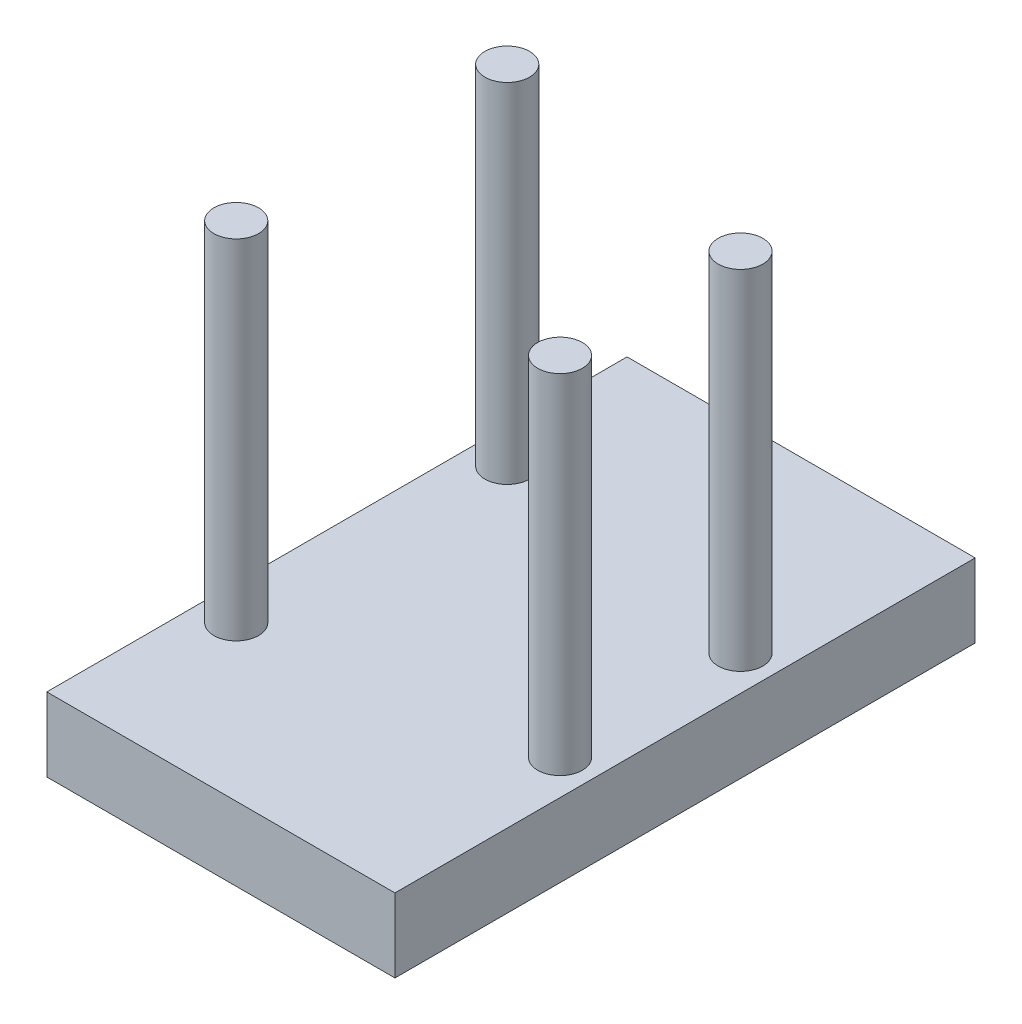
ISO-10303-21;
HEADER;
FILE_DESCRIPTION(('STEP AP214'),'2;1');
FILE_NAME('part.step','',(''),(''),'','','');
FILE_SCHEMA(('AUTOMOTIVE_DESIGN { 1 0 10303 214 1 1 1 1 }'));
ENDSEC;
DATA;
#1=APPLICATION_CONTEXT('core data for automotive mechanical design processes');
#2=APPLICATION_PROTOCOL_DEFINITION('international standard','automotive_design',2000,#1);
#3=PRODUCT_CONTEXT('',#1,'mechanical');
#4=PRODUCT('Part','Part','',(#3));
#5=PRODUCT_RELATED_PRODUCT_CATEGORY('part','',(#4));
#6=PRODUCT_DEFINITION_FORMATION('','',#4);
#7=PRODUCT_DEFINITION_CONTEXT('part definition',#1,'design');
#8=PRODUCT_DEFINITION('design','',#6,#7);
#9=PRODUCT_DEFINITION_SHAPE('','',#8);
#10=(LENGTH_UNIT() NAMED_UNIT(*) SI_UNIT(.MILLI.,.METRE.));
#11=(NAMED_UNIT(*) PLANE_ANGLE_UNIT() SI_UNIT($,.RADIAN.));
#12=(NAMED_UNIT(*) SI_UNIT($,.STERADIAN.) SOLID_ANGLE_UNIT());
#13=UNCERTAINTY_MEASURE_WITH_UNIT(LENGTH_MEASURE(1.E-05),#10,'distance_accuracy_value','');
#14=(GEOMETRIC_REPRESENTATION_CONTEXT(3) GLOBAL_UNCERTAINTY_ASSIGNED_CONTEXT((#13)) GLOBAL_UNIT_ASSIGNED_CONTEXT((#10,
#11,#12)) REPRESENTATION_CONTEXT('',''));
#15=CARTESIAN_POINT('',(0.,0.,0.));
#16=DIRECTION('',(0.,0.,1.));
#17=DIRECTION('',(1.,0.,0.));
#18=AXIS2_PLACEMENT_3D('',#15,#16,#17);
#19=CARTESIAN_POINT('',(-30.,12.7,50.));
#20=DIRECTION('',(1.,0.,0.));
#21=DIRECTION('',(0.,0.,-1.));
#22=AXIS2_PLACEMENT_3D('',#19,#20,#21);
#23=PLANE('',#22);
#24=DIRECTION('',(0.,0.,1.));
#25=VECTOR('',#24,1.);
#26=CARTESIAN_POINT('',(-30.,0.,50.));
#27=LINE('',#26,#25);
#28=CARTESIAN_POINT('',(-30.,0.,-50.));
#29=VERTEX_POINT('',#28);
#30=CARTESIAN_POINT('',(-30.,0.,50.));
#31=VERTEX_POINT('',#30);
#32=EDGE_CURVE('E107',#29,#31,#27,.T.);
#33=ORIENTED_EDGE('',*,*,#32,.T.);
#34=DIRECTION('',(0.,-1.,0.));
#35=VECTOR('',#34,1.);
#36=CARTESIAN_POINT('',(-30.,12.7,50.));
#37=LINE('',#36,#35);
#38=CARTESIAN_POINT('',(-30.,12.7,50.));
#39=VERTEX_POINT('',#38);
#40=EDGE_CURVE('E11',#39,#31,#37,.T.);
#41=ORIENTED_EDGE('',*,*,#40,.F.);
#42=DIRECTION('',(0.,0.,1.));
#43=VECTOR('',#42,1.);
#44=CARTESIAN_POINT('',(-30.,12.7,50.));
#45=LINE('',#44,#43);
#46=CARTESIAN_POINT('',(-30.,12.7,-50.));
#47=VERTEX_POINT('',#46);
#48=EDGE_CURVE('E91',#47,#39,#45,.T.);
#49=ORIENTED_EDGE('',*,*,#48,.F.);
#50=DIRECTION('',(0.,-1.,0.));
#51=VECTOR('',#50,1.);
#52=CARTESIAN_POINT('',(-30.,12.7,-50.));
#53=LINE('',#52,#51);
#54=EDGE_CURVE('E103',#47,#29,#53,.T.);
#55=ORIENTED_EDGE('',*,*,#54,.T.);
#56=EDGE_LOOP('',(#33,#41,#49,#55));
#57=FACE_BOUND('',#56,.T.);
#58=ADVANCED_FACE('F39',(#57),#23,.F.);
#59=CARTESIAN_POINT('',(30.,12.7,50.));
#60=DIRECTION('',(0.,0.,-1.));
#61=DIRECTION('',(-1.,0.,0.));
#62=AXIS2_PLACEMENT_3D('',#59,#60,#61);
#63=PLANE('',#62);
#64=DIRECTION('',(1.,0.,0.));
#65=VECTOR('',#64,1.);
#66=CARTESIAN_POINT('',(30.,0.,50.));
#67=LINE('',#66,#65);
#68=CARTESIAN_POINT('',(30.,0.,50.));
#69=VERTEX_POINT('',#68);
#70=EDGE_CURVE('E96',#31,#69,#67,.T.);
#71=ORIENTED_EDGE('',*,*,#70,.T.);
#72=DIRECTION('',(0.,-1.,0.));
#73=VECTOR('',#72,1.);
#74=CARTESIAN_POINT('',(30.,12.7,50.));
#75=LINE('',#74,#73);
#76=CARTESIAN_POINT('',(30.,12.7,50.));
#77=VERTEX_POINT('',#76);
#78=EDGE_CURVE('E48',#77,#69,#75,.T.);
#79=ORIENTED_EDGE('',*,*,#78,.F.);
#80=DIRECTION('',(1.,0.,0.));
#81=VECTOR('',#80,1.);
#82=CARTESIAN_POINT('',(30.,12.7,50.));
#83=LINE('',#82,#81);
#84=EDGE_CURVE('E86',#39,#77,#83,.T.);
#85=ORIENTED_EDGE('',*,*,#84,.F.);
#86=ORIENTED_EDGE('',*,*,#40,.T.);
#87=EDGE_LOOP('',(#71,#79,#85,#86));
#88=FACE_BOUND('',#87,.T.);
#89=ADVANCED_FACE('F95',(#88),#63,.F.);
#90=CARTESIAN_POINT('',(30.,12.7,50.));
#91=DIRECTION('',(-1.,0.,0.));
#92=DIRECTION('',(0.,0.,1.));
#93=AXIS2_PLACEMENT_3D('',#90,#91,#92);
#94=PLANE('',#93);
#95=DIRECTION('',(0.,0.,-1.));
#96=VECTOR('',#95,1.);
#97=CARTESIAN_POINT('',(30.,0.,50.));
#98=LINE('',#97,#96);
#99=CARTESIAN_POINT('',(30.,0.,-50.));
#100=VERTEX_POINT('',#99);
#101=EDGE_CURVE('E73',#69,#100,#98,.T.);
#102=ORIENTED_EDGE('',*,*,#101,.T.);
#103=DIRECTION('',(0.,-1.,0.));
#104=VECTOR('',#103,1.);
#105=CARTESIAN_POINT('',(30.,12.7,-50.));
#106=LINE('',#105,#104);
#107=CARTESIAN_POINT('',(30.,12.7,-50.));
#108=VERTEX_POINT('',#107);
#109=EDGE_CURVE('E98',#108,#100,#106,.T.);
#110=ORIENTED_EDGE('',*,*,#109,.F.);
#111=DIRECTION('',(0.,0.,-1.));
#112=VECTOR('',#111,1.);
#113=CARTESIAN_POINT('',(30.,12.7,50.));
#114=LINE('',#113,#112);
#115=EDGE_CURVE('E89',#77,#108,#114,.T.);
#116=ORIENTED_EDGE('',*,*,#115,.F.);
#117=ORIENTED_EDGE('',*,*,#78,.T.);
#118=EDGE_LOOP('',(#102,#110,#116,#117));
#119=FACE_BOUND('',#118,.T.);
#120=ADVANCED_FACE('F99',(#119),#94,.F.);
#121=CARTESIAN_POINT('',(30.,12.7,-50.));
#122=DIRECTION('',(0.,0.,1.));
#123=DIRECTION('',(1.,0.,0.));
#124=AXIS2_PLACEMENT_3D('',#121,#122,#123);
#125=PLANE('',#124);
#126=DIRECTION('',(-1.,0.,0.));
#127=VECTOR('',#126,1.);
#128=CARTESIAN_POINT('',(30.,0.,-50.));
#129=LINE('',#128,#127);
#130=EDGE_CURVE('E79',#100,#29,#129,.T.);
#131=ORIENTED_EDGE('',*,*,#130,.T.);
#132=ORIENTED_EDGE('',*,*,#54,.F.);
#133=DIRECTION('',(-1.,0.,0.));
#134=VECTOR('',#133,1.);
#135=CARTESIAN_POINT('',(30.,12.7,-50.));
#136=LINE('',#135,#134);
#137=EDGE_CURVE('E56',#108,#47,#136,.T.);
#138=ORIENTED_EDGE('',*,*,#137,.F.);
#139=ORIENTED_EDGE('',*,*,#109,.T.);
#140=EDGE_LOOP('',(#131,#132,#138,#139));
#141=FACE_BOUND('',#140,.T.);
#142=ADVANCED_FACE('F121',(#141),#125,.F.);
#143=CARTESIAN_POINT('',(0.,12.7,0.));
#144=DIRECTION('',(0.,1.,0.));
#145=DIRECTION('',(0.,0.,1.));
#146=AXIS2_PLACEMENT_3D('',#143,#144,#145);
#147=PLANE('',#146);
#148=CARTESIAN_POINT('',(24.,12.7,-15.55));
#149=DIRECTION('',(0.,1.,0.));
#150=DIRECTION('',(0.,0.,1.));
#151=AXIS2_PLACEMENT_3D('',#148,#149,#150);
#152=CIRCLE('',#151,3.85);
#153=CARTESIAN_POINT('',(24.,12.7,-11.7));
#154=VERTEX_POINT('',#153);
#155=EDGE_CURVE('E152',#154,#154,#152,.T.);
#156=ORIENTED_EDGE('',*,*,#155,.F.);
#157=EDGE_LOOP('',(#156));
#158=FACE_BOUND('',#157,.T.);
#159=CARTESIAN_POINT('',(24.,12.7,15.55));
#160=DIRECTION('',(0.,1.,0.));
#161=DIRECTION('',(0.,0.,1.));
#162=AXIS2_PLACEMENT_3D('',#159,#160,#161);
#163=CIRCLE('',#162,3.85);
#164=CARTESIAN_POINT('',(24.,12.7,19.4));
#165=VERTEX_POINT('',#164);
#166=EDGE_CURVE('E144',#165,#165,#163,.T.);
#167=ORIENTED_EDGE('',*,*,#166,.F.);
#168=EDGE_LOOP('',(#167));
#169=FACE_BOUND('',#168,.T.);
#170=CARTESIAN_POINT('',(-24.,12.7,23.35));
#171=DIRECTION('',(0.,1.,0.));
#172=DIRECTION('',(0.,0.,1.));
#173=AXIS2_PLACEMENT_3D('',#170,#171,#172);
#174=CIRCLE('',#173,3.85);
#175=CARTESIAN_POINT('',(-24.,12.7,27.2));
#176=VERTEX_POINT('',#175);
#177=EDGE_CURVE('E136',#176,#176,#174,.T.);
#178=ORIENTED_EDGE('',*,*,#177,.F.);
#179=EDGE_LOOP('',(#178));
#180=FACE_BOUND('',#179,.T.);
#181=CARTESIAN_POINT('',(-24.,12.7,-23.35));
#182=DIRECTION('',(0.,1.,0.));
#183=DIRECTION('',(0.,0.,1.));
#184=AXIS2_PLACEMENT_3D('',#181,#182,#183);
#185=CIRCLE('',#184,3.85);
#186=CARTESIAN_POINT('',(-24.,12.7,-19.5));
#187=VERTEX_POINT('',#186);
#188=EDGE_CURVE('E128',#187,#187,#185,.T.);
#189=ORIENTED_EDGE('',*,*,#188,.F.);
#190=EDGE_LOOP('',(#189));
#191=FACE_BOUND('',#190,.T.);
#192=ORIENTED_EDGE('',*,*,#48,.T.);
#193=ORIENTED_EDGE('',*,*,#84,.T.);
#194=ORIENTED_EDGE('',*,*,#115,.T.);
#195=ORIENTED_EDGE('',*,*,#137,.T.);
#196=EDGE_LOOP('',(#192,#193,#194,#195));
#197=FACE_BOUND('',#196,.T.);
#198=ADVANCED_FACE('F87',(#158,#169,#180,#191,#197),#147,.T.);
#199=CARTESIAN_POINT('',(0.,0.,0.));
#200=DIRECTION('',(0.,1.,0.));
#201=DIRECTION('',(0.,0.,1.));
#202=AXIS2_PLACEMENT_3D('',#199,#200,#201);
#203=PLANE('',#202);
#204=ORIENTED_EDGE('',*,*,#32,.F.);
#205=ORIENTED_EDGE('',*,*,#130,.F.);
#206=ORIENTED_EDGE('',*,*,#101,.F.);
#207=ORIENTED_EDGE('',*,*,#70,.F.);
#208=EDGE_LOOP('',(#204,#205,#206,#207));
#209=FACE_BOUND('',#208,.T.);
#210=ADVANCED_FACE('F124',(#209),#203,.F.);
#211=CARTESIAN_POINT('',(-24.,72.7,-23.35));
#212=DIRECTION('',(0.,-1.,0.));
#213=DIRECTION('',(0.,0.,-1.));
#214=AXIS2_PLACEMENT_3D('',#211,#212,#213);
#215=CYLINDRICAL_SURFACE('',#214,3.85);
#216=CARTESIAN_POINT('',(-24.,72.7,-23.35));
#217=DIRECTION('',(0.,1.,0.));
#218=DIRECTION('',(0.,0.,1.));
#219=AXIS2_PLACEMENT_3D('',#216,#217,#218);
#220=CIRCLE('',#219,3.85);
#221=CARTESIAN_POINT('',(-24.,72.7,-19.5));
#222=VERTEX_POINT('',#221);
#223=EDGE_CURVE('E111',#222,#222,#220,.T.);
#224=ORIENTED_EDGE('',*,*,#223,.F.);
#225=EDGE_LOOP('',(#224));
#226=FACE_BOUND('',#225,.T.);
#227=ORIENTED_EDGE('',*,*,#188,.T.);
#228=EDGE_LOOP('',(#227));
#229=FACE_BOUND('',#228,.T.);
#230=ADVANCED_FACE('F178',(#226,#229),#215,.T.);
#231=CARTESIAN_POINT('',(-24.,72.7,-23.35));
#232=DIRECTION('',(0.,1.,0.));
#233=DIRECTION('',(0.,0.,1.));
#234=AXIS2_PLACEMENT_3D('',#231,#232,#233);
#235=PLANE('',#234);
#236=ORIENTED_EDGE('',*,*,#223,.T.);
#237=EDGE_LOOP('',(#236));
#238=FACE_BOUND('',#237,.T.);
#239=ADVANCED_FACE('F180',(#238),#235,.T.);
#240=CARTESIAN_POINT('',(-24.,72.7,23.35));
#241=DIRECTION('',(0.,-1.,0.));
#242=DIRECTION('',(0.,0.,-1.));
#243=AXIS2_PLACEMENT_3D('',#240,#241,#242);
#244=CYLINDRICAL_SURFACE('',#243,3.85);
#245=CARTESIAN_POINT('',(-24.,72.7,23.35));
#246=DIRECTION('',(0.,1.,0.));
#247=DIRECTION('',(0.,0.,1.));
#248=AXIS2_PLACEMENT_3D('',#245,#246,#247);
#249=CIRCLE('',#248,3.85);
#250=CARTESIAN_POINT('',(-24.,72.7,27.2));
#251=VERTEX_POINT('',#250);
#252=EDGE_CURVE('E132',#251,#251,#249,.T.);
#253=ORIENTED_EDGE('',*,*,#252,.F.);
#254=EDGE_LOOP('',(#253));
#255=FACE_BOUND('',#254,.T.);
#256=ORIENTED_EDGE('',*,*,#177,.T.);
#257=EDGE_LOOP('',(#256));
#258=FACE_BOUND('',#257,.T.);
#259=ADVANCED_FACE('F187',(#255,#258),#244,.T.);
#260=CARTESIAN_POINT('',(-24.,72.7,23.35));
#261=DIRECTION('',(0.,1.,0.));
#262=DIRECTION('',(0.,0.,1.));
#263=AXIS2_PLACEMENT_3D('',#260,#261,#262);
#264=PLANE('',#263);
#265=ORIENTED_EDGE('',*,*,#252,.T.);
#266=EDGE_LOOP('',(#265));
#267=FACE_BOUND('',#266,.T.);
#268=ADVANCED_FACE('F235',(#267),#264,.T.);
#269=CARTESIAN_POINT('',(24.,72.7,15.55));
#270=DIRECTION('',(0.,-1.,0.));
#271=DIRECTION('',(0.,0.,-1.));
#272=AXIS2_PLACEMENT_3D('',#269,#270,#271);
#273=CYLINDRICAL_SURFACE('',#272,3.85);
#274=CARTESIAN_POINT('',(24.,72.7,15.55));
#275=DIRECTION('',(0.,1.,0.));
#276=DIRECTION('',(0.,0.,1.));
#277=AXIS2_PLACEMENT_3D('',#274,#275,#276);
#278=CIRCLE('',#277,3.85);
#279=CARTESIAN_POINT('',(24.,72.7,19.4));
#280=VERTEX_POINT('',#279);
#281=EDGE_CURVE('E140',#280,#280,#278,.T.);
#282=ORIENTED_EDGE('',*,*,#281,.F.);
#283=EDGE_LOOP('',(#282));
#284=FACE_BOUND('',#283,.T.);
#285=ORIENTED_EDGE('',*,*,#166,.T.);
#286=EDGE_LOOP('',(#285));
#287=FACE_BOUND('',#286,.T.);
#288=ADVANCED_FACE('F244',(#284,#287),#273,.T.);
#289=CARTESIAN_POINT('',(24.,72.7,15.55));
#290=DIRECTION('',(0.,1.,0.));
#291=DIRECTION('',(0.,0.,1.));
#292=AXIS2_PLACEMENT_3D('',#289,#290,#291);
#293=PLANE('',#292);
#294=ORIENTED_EDGE('',*,*,#281,.T.);
#295=EDGE_LOOP('',(#294));
#296=FACE_BOUND('',#295,.T.);
#297=ADVANCED_FACE('F165',(#296),#293,.T.);
#298=CARTESIAN_POINT('',(24.,72.7,-15.55));
#299=DIRECTION('',(0.,-1.,0.));
#300=DIRECTION('',(0.,0.,-1.));
#301=AXIS2_PLACEMENT_3D('',#298,#299,#300);
#302=CYLINDRICAL_SURFACE('',#301,3.85);
#303=CARTESIAN_POINT('',(24.,72.7,-15.55));
#304=DIRECTION('',(0.,1.,0.));
#305=DIRECTION('',(0.,0.,1.));
#306=AXIS2_PLACEMENT_3D('',#303,#304,#305);
#307=CIRCLE('',#306,3.85);
#308=CARTESIAN_POINT('',(24.,72.7,-11.7));
#309=VERTEX_POINT('',#308);
#310=EDGE_CURVE('E148',#309,#309,#307,.T.);
#311=ORIENTED_EDGE('',*,*,#310,.F.);
#312=EDGE_LOOP('',(#311));
#313=FACE_BOUND('',#312,.T.);
#314=ORIENTED_EDGE('',*,*,#155,.T.);
#315=EDGE_LOOP('',(#314));
#316=FACE_BOUND('',#315,.T.);
#317=ADVANCED_FACE('F162',(#313,#316),#302,.T.);
#318=CARTESIAN_POINT('',(24.,72.7,-15.55));
#319=DIRECTION('',(0.,1.,0.));
#320=DIRECTION('',(0.,0.,1.));
#321=AXIS2_PLACEMENT_3D('',#318,#319,#320);
#322=PLANE('',#321);
#323=ORIENTED_EDGE('',*,*,#310,.T.);
#324=EDGE_LOOP('',(#323));
#325=FACE_BOUND('',#324,.T.);
#326=ADVANCED_FACE('F160',(#325),#322,.T.);
#327=CLOSED_SHELL('',(#58,#89,#120,#142,#198,#210,#230,#239,#259,#268,#288,#297,#317,#326));
#328=MANIFOLD_SOLID_BREP('B2',#327);
#329=ADVANCED_BREP_SHAPE_REPRESENTATION('',(#18,#328),#14);
#330=SHAPE_DEFINITION_REPRESENTATION(#9,#329);
ENDSEC;
END-ISO-10303-21;
